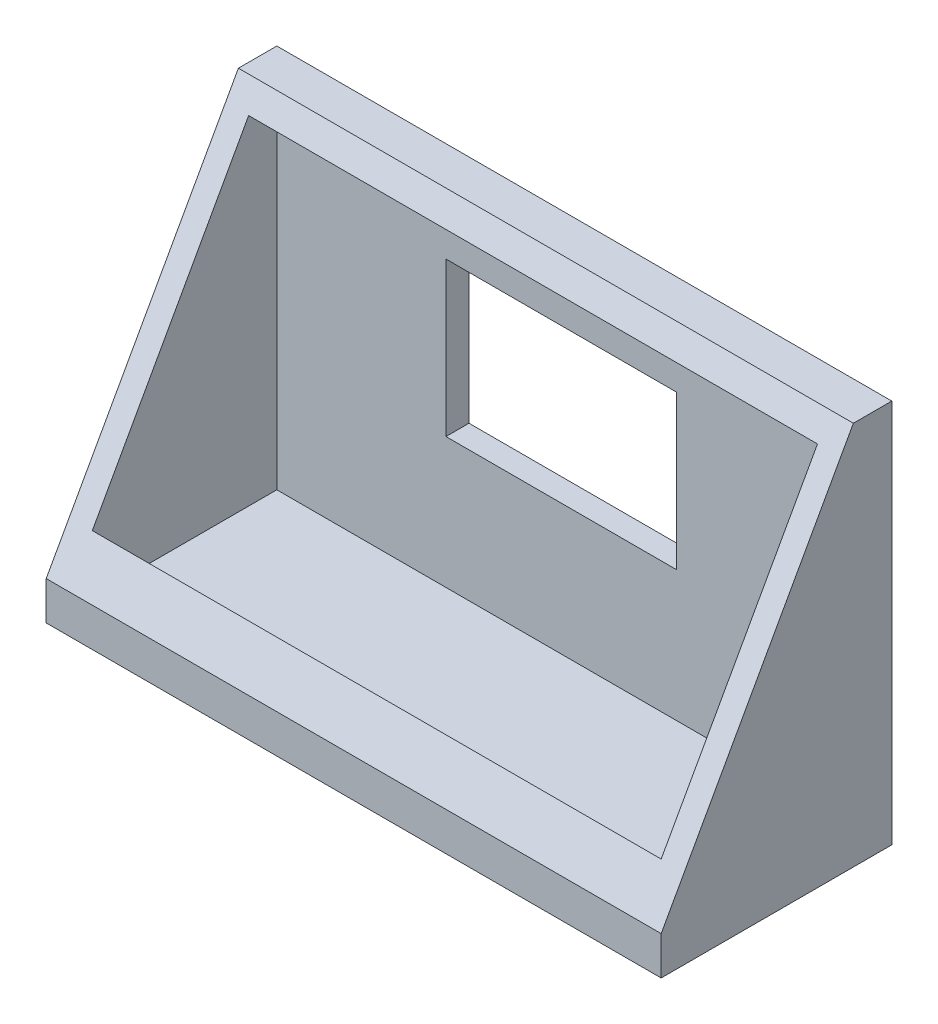
ISO-10303-21;
HEADER;
FILE_DESCRIPTION(('STEP AP214'),'2;1');
FILE_NAME('part.step','',(''),(''),'','','');
FILE_SCHEMA(('AUTOMOTIVE_DESIGN { 1 0 10303 214 1 1 1 1 }'));
ENDSEC;
DATA;
#1=APPLICATION_CONTEXT('core data for automotive mechanical design processes');
#2=APPLICATION_PROTOCOL_DEFINITION('international standard','automotive_design',2000,#1);
#3=PRODUCT_CONTEXT('',#1,'mechanical');
#4=PRODUCT('Part','Part','',(#3));
#5=PRODUCT_RELATED_PRODUCT_CATEGORY('part','',(#4));
#6=PRODUCT_DEFINITION_FORMATION('','',#4);
#7=PRODUCT_DEFINITION_CONTEXT('part definition',#1,'design');
#8=PRODUCT_DEFINITION('design','',#6,#7);
#9=PRODUCT_DEFINITION_SHAPE('','',#8);
#10=(LENGTH_UNIT() NAMED_UNIT(*) SI_UNIT(.MILLI.,.METRE.));
#11=(NAMED_UNIT(*) PLANE_ANGLE_UNIT() SI_UNIT($,.RADIAN.));
#12=(NAMED_UNIT(*) SI_UNIT($,.STERADIAN.) SOLID_ANGLE_UNIT());
#13=UNCERTAINTY_MEASURE_WITH_UNIT(LENGTH_MEASURE(1.E-05),#10,'distance_accuracy_value','');
#14=(GEOMETRIC_REPRESENTATION_CONTEXT(3) GLOBAL_UNCERTAINTY_ASSIGNED_CONTEXT((#13)) GLOBAL_UNIT_ASSIGNED_CONTEXT((#10,
#11,#12)) REPRESENTATION_CONTEXT('',''));
#15=CARTESIAN_POINT('',(0.,0.,0.));
#16=DIRECTION('',(0.,0.,1.));
#17=DIRECTION('',(1.,0.,0.));
#18=AXIS2_PLACEMENT_3D('',#15,#16,#17);
#19=CARTESIAN_POINT('',(40.,50.,5.));
#20=DIRECTION('',(0.,-0.485642931178632,-0.874157276121538));
#21=DIRECTION('',(0.,0.874157276121538,-0.485642931178632));
#22=AXIS2_PLACEMENT_3D('',#19,#20,#21);
#23=PLANE('',#22);
#24=DIRECTION('',(0.,-0.874157276121538,0.485642931178632));
#25=VECTOR('',#24,1.);
#26=CARTESIAN_POINT('',(-40.,50.,5.));
#27=LINE('',#26,#25);
#28=CARTESIAN_POINT('',(-40.,50.,5.));
#29=VERTEX_POINT('',#28);
#30=CARTESIAN_POINT('',(-40.,5.,30.));
#31=VERTEX_POINT('',#30);
#32=EDGE_CURVE('E220',#29,#31,#27,.T.);
#33=ORIENTED_EDGE('',*,*,#32,.T.);
#34=DIRECTION('',(-1.,0.,0.));
#35=VECTOR('',#34,1.);
#36=CARTESIAN_POINT('',(40.,5.,30.));
#37=LINE('',#36,#35);
#38=CARTESIAN_POINT('',(40.,5.,30.));
#39=VERTEX_POINT('',#38);
#40=EDGE_CURVE('E228',#39,#31,#37,.T.);
#41=ORIENTED_EDGE('',*,*,#40,.F.);
#42=DIRECTION('',(0.,-0.874157276121538,0.485642931178632));
#43=VECTOR('',#42,1.);
#44=CARTESIAN_POINT('',(40.,50.,5.));
#45=LINE('',#44,#43);
#46=CARTESIAN_POINT('',(40.,50.,5.));
#47=VERTEX_POINT('',#46);
#48=EDGE_CURVE('E226',#47,#39,#45,.T.);
#49=ORIENTED_EDGE('',*,*,#48,.F.);
#50=DIRECTION('',(-1.,0.,0.));
#51=VECTOR('',#50,1.);
#52=CARTESIAN_POINT('',(40.,50.,5.));
#53=LINE('',#52,#51);
#54=EDGE_CURVE('E240',#47,#29,#53,.T.);
#55=ORIENTED_EDGE('',*,*,#54,.T.);
#56=EDGE_LOOP('',(#33,#41,#49,#55));
#57=FACE_BOUND('',#56,.T.);
#58=DIRECTION('',(0.,-0.874157276121538,0.485642931178632));
#59=VECTOR('',#58,1.);
#60=CARTESIAN_POINT('',(-37.,50.,5.));
#61=LINE('',#60,#59);
#62=CARTESIAN_POINT('',(-37.,47.,6.66666666666667));
#63=VERTEX_POINT('',#62);
#64=CARTESIAN_POINT('',(-37.,10.4,27.));
#65=VERTEX_POINT('',#64);
#66=EDGE_CURVE('E189',#63,#65,#61,.T.);
#67=ORIENTED_EDGE('',*,*,#66,.F.);
#68=DIRECTION('',(-1.,0.,0.));
#69=VECTOR('',#68,1.);
#70=CARTESIAN_POINT('',(40.,47.,6.66666666666667));
#71=LINE('',#70,#69);
#72=CARTESIAN_POINT('',(37.,47.,6.66666666666667));
#73=VERTEX_POINT('',#72);
#74=EDGE_CURVE('E201',#73,#63,#71,.T.);
#75=ORIENTED_EDGE('',*,*,#74,.F.);
#76=DIRECTION('',(0.,-0.874157276121538,0.485642931178632));
#77=VECTOR('',#76,1.);
#78=CARTESIAN_POINT('',(37.,50.,5.));
#79=LINE('',#78,#77);
#80=CARTESIAN_POINT('',(37.,10.4,27.));
#81=VERTEX_POINT('',#80);
#82=EDGE_CURVE('E207',#73,#81,#79,.T.);
#83=ORIENTED_EDGE('',*,*,#82,.T.);
#84=DIRECTION('',(-1.,0.,0.));
#85=VECTOR('',#84,1.);
#86=CARTESIAN_POINT('',(40.,10.4,27.));
#87=LINE('',#86,#85);
#88=EDGE_CURVE('E208',#81,#65,#87,.T.);
#89=ORIENTED_EDGE('',*,*,#88,.T.);
#90=EDGE_LOOP('',(#67,#75,#83,#89));
#91=FACE_BOUND('',#90,.T.);
#92=ADVANCED_FACE('F47',(#57,#91),#23,.F.);
#93=CARTESIAN_POINT('',(40.,5.,30.));
#94=DIRECTION('',(0.,0.,-1.));
#95=DIRECTION('',(-1.,0.,0.));
#96=AXIS2_PLACEMENT_3D('',#93,#94,#95);
#97=PLANE('',#96);
#98=DIRECTION('',(0.,-1.,0.));
#99=VECTOR('',#98,1.);
#100=CARTESIAN_POINT('',(-40.,5.,30.));
#101=LINE('',#100,#99);
#102=CARTESIAN_POINT('',(-40.,0.,30.));
#103=VERTEX_POINT('',#102);
#104=EDGE_CURVE('E183',#31,#103,#101,.T.);
#105=ORIENTED_EDGE('',*,*,#104,.T.);
#106=DIRECTION('',(-1.,0.,0.));
#107=VECTOR('',#106,1.);
#108=CARTESIAN_POINT('',(40.,0.,30.));
#109=LINE('',#108,#107);
#110=CARTESIAN_POINT('',(40.,0.,30.));
#111=VERTEX_POINT('',#110);
#112=EDGE_CURVE('E249',#111,#103,#109,.T.);
#113=ORIENTED_EDGE('',*,*,#112,.F.);
#114=DIRECTION('',(0.,-1.,0.));
#115=VECTOR('',#114,1.);
#116=CARTESIAN_POINT('',(40.,5.,30.));
#117=LINE('',#116,#115);
#118=EDGE_CURVE('E216',#39,#111,#117,.T.);
#119=ORIENTED_EDGE('',*,*,#118,.F.);
#120=ORIENTED_EDGE('',*,*,#40,.T.);
#121=EDGE_LOOP('',(#105,#113,#119,#120));
#122=FACE_BOUND('',#121,.T.);
#123=ADVANCED_FACE('F49',(#122),#97,.F.);
#124=CARTESIAN_POINT('',(40.,0.,30.));
#125=DIRECTION('',(0.,1.,0.));
#126=DIRECTION('',(0.,0.,1.));
#127=AXIS2_PLACEMENT_3D('',#124,#125,#126);
#128=PLANE('',#127);
#129=DIRECTION('',(0.,0.,-1.));
#130=VECTOR('',#129,1.);
#131=CARTESIAN_POINT('',(-40.,0.,30.));
#132=LINE('',#131,#130);
#133=CARTESIAN_POINT('',(-40.,0.,0.));
#134=VERTEX_POINT('',#133);
#135=EDGE_CURVE('E231',#103,#134,#132,.T.);
#136=ORIENTED_EDGE('',*,*,#135,.T.);
#137=DIRECTION('',(-1.,0.,0.));
#138=VECTOR('',#137,1.);
#139=CARTESIAN_POINT('',(40.,0.,0.));
#140=LINE('',#139,#138);
#141=CARTESIAN_POINT('',(40.,0.,0.));
#142=VERTEX_POINT('',#141);
#143=EDGE_CURVE('E246',#142,#134,#140,.T.);
#144=ORIENTED_EDGE('',*,*,#143,.F.);
#145=DIRECTION('',(0.,0.,-1.));
#146=VECTOR('',#145,1.);
#147=CARTESIAN_POINT('',(40.,0.,30.));
#148=LINE('',#147,#146);
#149=EDGE_CURVE('E219',#111,#142,#148,.T.);
#150=ORIENTED_EDGE('',*,*,#149,.F.);
#151=ORIENTED_EDGE('',*,*,#112,.T.);
#152=EDGE_LOOP('',(#136,#144,#150,#151));
#153=FACE_BOUND('',#152,.T.);
#154=ADVANCED_FACE('F265',(#153),#128,.F.);
#155=CARTESIAN_POINT('',(40.,0.,0.));
#156=DIRECTION('',(0.,0.,1.));
#157=DIRECTION('',(1.,0.,0.));
#158=AXIS2_PLACEMENT_3D('',#155,#156,#157);
#159=PLANE('',#158);
#160=CARTESIAN_POINT('',(-30.,30.,0.));
#161=DIRECTION('',(0.,0.,1.));
#162=DIRECTION('',(1.,0.,0.));
#163=AXIS2_PLACEMENT_3D('',#160,#161,#162);
#164=CIRCLE('',#163,5.);
#165=CARTESIAN_POINT('',(-25.,30.,0.));
#166=VERTEX_POINT('',#165);
#167=EDGE_CURVE('E363',#166,#166,#164,.T.);
#168=ORIENTED_EDGE('',*,*,#167,.T.);
#169=EDGE_LOOP('',(#168));
#170=FACE_BOUND('',#169,.T.);
#171=CARTESIAN_POINT('',(30.,30.,0.));
#172=DIRECTION('',(0.,0.,1.));
#173=DIRECTION('',(1.,0.,0.));
#174=AXIS2_PLACEMENT_3D('',#171,#172,#173);
#175=CIRCLE('',#174,5.);
#176=CARTESIAN_POINT('',(35.,30.,0.));
#177=VERTEX_POINT('',#176);
#178=EDGE_CURVE('E55',#177,#177,#175,.F.);
#179=ORIENTED_EDGE('',*,*,#178,.F.);
#180=EDGE_LOOP('',(#179));
#181=FACE_BOUND('',#180,.T.);
#182=DIRECTION('',(0.,1.,0.));
#183=VECTOR('',#182,1.);
#184=CARTESIAN_POINT('',(15.,20.,0.));
#185=LINE('',#184,#183);
#186=CARTESIAN_POINT('',(15.,20.,0.));
#187=VERTEX_POINT('',#186);
#188=CARTESIAN_POINT('',(15.,40.,0.));
#189=VERTEX_POINT('',#188);
#190=EDGE_CURVE('E160',#187,#189,#185,.T.);
#191=ORIENTED_EDGE('',*,*,#190,.T.);
#192=DIRECTION('',(1.,0.,0.));
#193=VECTOR('',#192,1.);
#194=CARTESIAN_POINT('',(-15.,40.,0.));
#195=LINE('',#194,#193);
#196=CARTESIAN_POINT('',(-15.,40.,0.));
#197=VERTEX_POINT('',#196);
#198=EDGE_CURVE('E62',#197,#189,#195,.T.);
#199=ORIENTED_EDGE('',*,*,#198,.F.);
#200=DIRECTION('',(0.,1.,0.));
#201=VECTOR('',#200,1.);
#202=CARTESIAN_POINT('',(-15.,20.,0.));
#203=LINE('',#202,#201);
#204=CARTESIAN_POINT('',(-15.,20.,0.));
#205=VERTEX_POINT('',#204);
#206=EDGE_CURVE('E167',#205,#197,#203,.T.);
#207=ORIENTED_EDGE('',*,*,#206,.F.);
#208=DIRECTION('',(1.,0.,0.));
#209=VECTOR('',#208,1.);
#210=CARTESIAN_POINT('',(-15.,20.,0.));
#211=LINE('',#210,#209);
#212=EDGE_CURVE('E151',#205,#187,#211,.T.);
#213=ORIENTED_EDGE('',*,*,#212,.T.);
#214=EDGE_LOOP('',(#191,#199,#207,#213));
#215=FACE_BOUND('',#214,.T.);
#216=DIRECTION('',(0.,1.,0.));
#217=VECTOR('',#216,1.);
#218=CARTESIAN_POINT('',(-40.,0.,0.));
#219=LINE('',#218,#217);
#220=CARTESIAN_POINT('',(-40.,50.,0.));
#221=VERTEX_POINT('',#220);
#222=EDGE_CURVE('E233',#134,#221,#219,.T.);
#223=ORIENTED_EDGE('',*,*,#222,.T.);
#224=DIRECTION('',(-1.,0.,0.));
#225=VECTOR('',#224,1.);
#226=CARTESIAN_POINT('',(40.,50.,0.));
#227=LINE('',#226,#225);
#228=CARTESIAN_POINT('',(40.,50.,0.));
#229=VERTEX_POINT('',#228);
#230=EDGE_CURVE('E243',#229,#221,#227,.T.);
#231=ORIENTED_EDGE('',*,*,#230,.F.);
#232=DIRECTION('',(0.,1.,0.));
#233=VECTOR('',#232,1.);
#234=CARTESIAN_POINT('',(40.,0.,0.));
#235=LINE('',#234,#233);
#236=EDGE_CURVE('E222',#142,#229,#235,.T.);
#237=ORIENTED_EDGE('',*,*,#236,.F.);
#238=ORIENTED_EDGE('',*,*,#143,.T.);
#239=EDGE_LOOP('',(#223,#231,#237,#238));
#240=FACE_BOUND('',#239,.T.);
#241=ADVANCED_FACE('F164',(#170,#181,#215,#240),#159,.F.);
#242=CARTESIAN_POINT('',(40.,50.,0.));
#243=DIRECTION('',(0.,-1.,0.));
#244=DIRECTION('',(0.,0.,-1.));
#245=AXIS2_PLACEMENT_3D('',#242,#243,#244);
#246=PLANE('',#245);
#247=DIRECTION('',(0.,0.,1.));
#248=VECTOR('',#247,1.);
#249=CARTESIAN_POINT('',(-40.,50.,0.));
#250=LINE('',#249,#248);
#251=EDGE_CURVE('E235',#221,#29,#250,.T.);
#252=ORIENTED_EDGE('',*,*,#251,.T.);
#253=ORIENTED_EDGE('',*,*,#54,.F.);
#254=DIRECTION('',(0.,0.,1.));
#255=VECTOR('',#254,1.);
#256=CARTESIAN_POINT('',(40.,50.,0.));
#257=LINE('',#256,#255);
#258=EDGE_CURVE('E224',#229,#47,#257,.T.);
#259=ORIENTED_EDGE('',*,*,#258,.F.);
#260=ORIENTED_EDGE('',*,*,#230,.T.);
#261=EDGE_LOOP('',(#252,#253,#259,#260));
#262=FACE_BOUND('',#261,.T.);
#263=ADVANCED_FACE('F264',(#262),#246,.F.);
#264=CARTESIAN_POINT('',(40.,0.,0.));
#265=DIRECTION('',(1.,0.,0.));
#266=DIRECTION('',(0.,0.,-1.));
#267=AXIS2_PLACEMENT_3D('',#264,#265,#266);
#268=PLANE('',#267);
#269=ORIENTED_EDGE('',*,*,#118,.T.);
#270=ORIENTED_EDGE('',*,*,#149,.T.);
#271=ORIENTED_EDGE('',*,*,#236,.T.);
#272=ORIENTED_EDGE('',*,*,#258,.T.);
#273=ORIENTED_EDGE('',*,*,#48,.T.);
#274=EDGE_LOOP('',(#269,#270,#271,#272,#273));
#275=FACE_BOUND('',#274,.T.);
#276=ADVANCED_FACE('F274',(#275),#268,.T.);
#277=CARTESIAN_POINT('',(-40.,0.,0.));
#278=DIRECTION('',(1.,0.,0.));
#279=DIRECTION('',(0.,0.,-1.));
#280=AXIS2_PLACEMENT_3D('',#277,#278,#279);
#281=PLANE('',#280);
#282=ORIENTED_EDGE('',*,*,#104,.F.);
#283=ORIENTED_EDGE('',*,*,#32,.F.);
#284=ORIENTED_EDGE('',*,*,#251,.F.);
#285=ORIENTED_EDGE('',*,*,#222,.F.);
#286=ORIENTED_EDGE('',*,*,#135,.F.);
#287=EDGE_LOOP('',(#282,#283,#284,#285,#286));
#288=FACE_BOUND('',#287,.T.);
#289=ADVANCED_FACE('F295',(#288),#281,.F.);
#290=CARTESIAN_POINT('',(40.,5.,27.));
#291=DIRECTION('',(0.,0.,-1.));
#292=DIRECTION('',(-1.,0.,0.));
#293=AXIS2_PLACEMENT_3D('',#290,#291,#292);
#294=PLANE('',#293);
#295=DIRECTION('',(0.,-1.,0.));
#296=VECTOR('',#295,1.);
#297=CARTESIAN_POINT('',(-37.,5.,27.));
#298=LINE('',#297,#296);
#299=CARTESIAN_POINT('',(-37.,3.,27.));
#300=VERTEX_POINT('',#299);
#301=EDGE_CURVE('E174',#65,#300,#298,.T.);
#302=ORIENTED_EDGE('',*,*,#301,.F.);
#303=ORIENTED_EDGE('',*,*,#88,.F.);
#304=DIRECTION('',(0.,-1.,0.));
#305=VECTOR('',#304,1.);
#306=CARTESIAN_POINT('',(37.,5.,27.));
#307=LINE('',#306,#305);
#308=CARTESIAN_POINT('',(37.,3.,27.));
#309=VERTEX_POINT('',#308);
#310=EDGE_CURVE('E185',#81,#309,#307,.T.);
#311=ORIENTED_EDGE('',*,*,#310,.T.);
#312=DIRECTION('',(-1.,0.,0.));
#313=VECTOR('',#312,1.);
#314=CARTESIAN_POINT('',(40.,3.,27.));
#315=LINE('',#314,#313);
#316=EDGE_CURVE('E180',#309,#300,#315,.T.);
#317=ORIENTED_EDGE('',*,*,#316,.T.);
#318=EDGE_LOOP('',(#302,#303,#311,#317));
#319=FACE_BOUND('',#318,.T.);
#320=ADVANCED_FACE('F298',(#319),#294,.T.);
#321=CARTESIAN_POINT('',(40.,3.,30.));
#322=DIRECTION('',(0.,1.,0.));
#323=DIRECTION('',(0.,0.,1.));
#324=AXIS2_PLACEMENT_3D('',#321,#322,#323);
#325=PLANE('',#324);
#326=DIRECTION('',(0.,0.,-1.));
#327=VECTOR('',#326,1.);
#328=CARTESIAN_POINT('',(-37.,3.,30.));
#329=LINE('',#328,#327);
#330=CARTESIAN_POINT('',(-37.,3.,3.));
#331=VERTEX_POINT('',#330);
#332=EDGE_CURVE('E179',#300,#331,#329,.T.);
#333=ORIENTED_EDGE('',*,*,#332,.F.);
#334=ORIENTED_EDGE('',*,*,#316,.F.);
#335=DIRECTION('',(0.,0.,-1.));
#336=VECTOR('',#335,1.);
#337=CARTESIAN_POINT('',(37.,3.,30.));
#338=LINE('',#337,#336);
#339=CARTESIAN_POINT('',(37.,3.,3.));
#340=VERTEX_POINT('',#339);
#341=EDGE_CURVE('E188',#309,#340,#338,.T.);
#342=ORIENTED_EDGE('',*,*,#341,.T.);
#343=DIRECTION('',(-1.,0.,0.));
#344=VECTOR('',#343,1.);
#345=CARTESIAN_POINT('',(40.,3.,3.));
#346=LINE('',#345,#344);
#347=EDGE_CURVE('E184',#340,#331,#346,.T.);
#348=ORIENTED_EDGE('',*,*,#347,.T.);
#349=EDGE_LOOP('',(#333,#334,#342,#348));
#350=FACE_BOUND('',#349,.T.);
#351=ADVANCED_FACE('F319',(#350),#325,.T.);
#352=CARTESIAN_POINT('',(40.,0.,3.));
#353=DIRECTION('',(0.,0.,1.));
#354=DIRECTION('',(1.,0.,0.));
#355=AXIS2_PLACEMENT_3D('',#352,#353,#354);
#356=PLANE('',#355);
#357=DIRECTION('',(-1.,0.,0.));
#358=VECTOR('',#357,1.);
#359=CARTESIAN_POINT('',(40.,40.,3.));
#360=LINE('',#359,#358);
#361=CARTESIAN_POINT('',(15.,40.,3.));
#362=VERTEX_POINT('',#361);
#363=CARTESIAN_POINT('',(-15.,40.,3.));
#364=VERTEX_POINT('',#363);
#365=EDGE_CURVE('E257',#362,#364,#360,.T.);
#366=ORIENTED_EDGE('',*,*,#365,.F.);
#367=DIRECTION('',(0.,-1.,0.));
#368=VECTOR('',#367,1.);
#369=CARTESIAN_POINT('',(15.,0.,3.));
#370=LINE('',#369,#368);
#371=CARTESIAN_POINT('',(15.,20.,3.));
#372=VERTEX_POINT('',#371);
#373=EDGE_CURVE('E252',#362,#372,#370,.T.);
#374=ORIENTED_EDGE('',*,*,#373,.T.);
#375=DIRECTION('',(-1.,0.,0.));
#376=VECTOR('',#375,1.);
#377=CARTESIAN_POINT('',(40.,20.,3.));
#378=LINE('',#377,#376);
#379=CARTESIAN_POINT('',(-15.,20.,3.));
#380=VERTEX_POINT('',#379);
#381=EDGE_CURVE('E154',#372,#380,#378,.T.);
#382=ORIENTED_EDGE('',*,*,#381,.T.);
#383=DIRECTION('',(0.,-1.,0.));
#384=VECTOR('',#383,1.);
#385=CARTESIAN_POINT('',(-15.,0.,3.));
#386=LINE('',#385,#384);
#387=EDGE_CURVE('E255',#364,#380,#386,.T.);
#388=ORIENTED_EDGE('',*,*,#387,.F.);
#389=EDGE_LOOP('',(#366,#374,#382,#388));
#390=FACE_BOUND('',#389,.T.);
#391=DIRECTION('',(0.,1.,0.));
#392=VECTOR('',#391,1.);
#393=CARTESIAN_POINT('',(-37.,0.,3.));
#394=LINE('',#393,#392);
#395=CARTESIAN_POINT('',(-37.,47.,3.));
#396=VERTEX_POINT('',#395);
#397=EDGE_CURVE('E191',#331,#396,#394,.T.);
#398=ORIENTED_EDGE('',*,*,#397,.F.);
#399=ORIENTED_EDGE('',*,*,#347,.F.);
#400=DIRECTION('',(0.,1.,0.));
#401=VECTOR('',#400,1.);
#402=CARTESIAN_POINT('',(37.,0.,3.));
#403=LINE('',#402,#401);
#404=CARTESIAN_POINT('',(37.,47.,3.));
#405=VERTEX_POINT('',#404);
#406=EDGE_CURVE('E196',#340,#405,#403,.T.);
#407=ORIENTED_EDGE('',*,*,#406,.T.);
#408=DIRECTION('',(-1.,0.,0.));
#409=VECTOR('',#408,1.);
#410=CARTESIAN_POINT('',(40.,47.,3.));
#411=LINE('',#410,#409);
#412=EDGE_CURVE('E194',#405,#396,#411,.T.);
#413=ORIENTED_EDGE('',*,*,#412,.T.);
#414=EDGE_LOOP('',(#398,#399,#407,#413));
#415=FACE_BOUND('',#414,.T.);
#416=ADVANCED_FACE('F315',(#390,#415),#356,.T.);
#417=CARTESIAN_POINT('',(40.,47.,0.));
#418=DIRECTION('',(0.,-1.,0.));
#419=DIRECTION('',(0.,0.,-1.));
#420=AXIS2_PLACEMENT_3D('',#417,#418,#419);
#421=PLANE('',#420);
#422=DIRECTION('',(0.,0.,1.));
#423=VECTOR('',#422,1.);
#424=CARTESIAN_POINT('',(-37.,47.,0.));
#425=LINE('',#424,#423);
#426=EDGE_CURVE('E198',#396,#63,#425,.T.);
#427=ORIENTED_EDGE('',*,*,#426,.F.);
#428=ORIENTED_EDGE('',*,*,#412,.F.);
#429=DIRECTION('',(0.,0.,1.));
#430=VECTOR('',#429,1.);
#431=CARTESIAN_POINT('',(37.,47.,0.));
#432=LINE('',#431,#430);
#433=EDGE_CURVE('E203',#405,#73,#432,.T.);
#434=ORIENTED_EDGE('',*,*,#433,.T.);
#435=ORIENTED_EDGE('',*,*,#74,.T.);
#436=EDGE_LOOP('',(#427,#428,#434,#435));
#437=FACE_BOUND('',#436,.T.);
#438=ADVANCED_FACE('F311',(#437),#421,.T.);
#439=CARTESIAN_POINT('',(37.,0.,0.));
#440=DIRECTION('',(1.,0.,0.));
#441=DIRECTION('',(0.,0.,-1.));
#442=AXIS2_PLACEMENT_3D('',#439,#440,#441);
#443=PLANE('',#442);
#444=ORIENTED_EDGE('',*,*,#310,.F.);
#445=ORIENTED_EDGE('',*,*,#82,.F.);
#446=ORIENTED_EDGE('',*,*,#433,.F.);
#447=ORIENTED_EDGE('',*,*,#406,.F.);
#448=ORIENTED_EDGE('',*,*,#341,.F.);
#449=EDGE_LOOP('',(#444,#445,#446,#447,#448));
#450=FACE_BOUND('',#449,.T.);
#451=ADVANCED_FACE('F307',(#450),#443,.F.);
#452=CARTESIAN_POINT('',(-37.,0.,0.));
#453=DIRECTION('',(1.,0.,0.));
#454=DIRECTION('',(0.,0.,-1.));
#455=AXIS2_PLACEMENT_3D('',#452,#453,#454);
#456=PLANE('',#455);
#457=ORIENTED_EDGE('',*,*,#301,.T.);
#458=ORIENTED_EDGE('',*,*,#332,.T.);
#459=ORIENTED_EDGE('',*,*,#397,.T.);
#460=ORIENTED_EDGE('',*,*,#426,.T.);
#461=ORIENTED_EDGE('',*,*,#66,.T.);
#462=EDGE_LOOP('',(#457,#458,#459,#460,#461));
#463=FACE_BOUND('',#462,.T.);
#464=ADVANCED_FACE('F303',(#463),#456,.T.);
#465=CARTESIAN_POINT('',(-15.,40.,80.));
#466=DIRECTION('',(0.,1.,0.));
#467=DIRECTION('',(-1.,0.,0.));
#468=AXIS2_PLACEMENT_3D('',#465,#466,#467);
#469=PLANE('',#468);
#470=ORIENTED_EDGE('',*,*,#365,.T.);
#471=DIRECTION('',(0.,0.,-1.));
#472=VECTOR('',#471,1.);
#473=CARTESIAN_POINT('',(-15.,40.,80.));
#474=LINE('',#473,#472);
#475=EDGE_CURVE('E172',#364,#197,#474,.T.);
#476=ORIENTED_EDGE('',*,*,#475,.T.);
#477=ORIENTED_EDGE('',*,*,#198,.T.);
#478=DIRECTION('',(0.,0.,-1.));
#479=VECTOR('',#478,1.);
#480=CARTESIAN_POINT('',(15.,40.,80.));
#481=LINE('',#480,#479);
#482=EDGE_CURVE('E157',#362,#189,#481,.T.);
#483=ORIENTED_EDGE('',*,*,#482,.F.);
#484=EDGE_LOOP('',(#470,#476,#477,#483));
#485=FACE_BOUND('',#484,.T.);
#486=ADVANCED_FACE('F306',(#485),#469,.F.);
#487=CARTESIAN_POINT('',(-15.,20.,80.));
#488=DIRECTION('',(-1.,0.,0.));
#489=DIRECTION('',(0.,-1.,0.));
#490=AXIS2_PLACEMENT_3D('',#487,#488,#489);
#491=PLANE('',#490);
#492=ORIENTED_EDGE('',*,*,#387,.T.);
#493=DIRECTION('',(0.,0.,-1.));
#494=VECTOR('',#493,1.);
#495=CARTESIAN_POINT('',(-15.,20.,80.));
#496=LINE('',#495,#494);
#497=EDGE_CURVE('E156',#380,#205,#496,.T.);
#498=ORIENTED_EDGE('',*,*,#497,.T.);
#499=ORIENTED_EDGE('',*,*,#206,.T.);
#500=ORIENTED_EDGE('',*,*,#475,.F.);
#501=EDGE_LOOP('',(#492,#498,#499,#500));
#502=FACE_BOUND('',#501,.T.);
#503=ADVANCED_FACE('F329',(#502),#491,.F.);
#504=CARTESIAN_POINT('',(-15.,20.,80.));
#505=DIRECTION('',(0.,1.,0.));
#506=DIRECTION('',(-1.,0.,0.));
#507=AXIS2_PLACEMENT_3D('',#504,#505,#506);
#508=PLANE('',#507);
#509=DIRECTION('',(0.,0.,-1.));
#510=VECTOR('',#509,1.);
#511=CARTESIAN_POINT('',(15.,20.,80.));
#512=LINE('',#511,#510);
#513=EDGE_CURVE('E70',#372,#187,#512,.T.);
#514=ORIENTED_EDGE('',*,*,#513,.T.);
#515=ORIENTED_EDGE('',*,*,#212,.F.);
#516=ORIENTED_EDGE('',*,*,#497,.F.);
#517=ORIENTED_EDGE('',*,*,#381,.F.);
#518=EDGE_LOOP('',(#514,#515,#516,#517));
#519=FACE_BOUND('',#518,.T.);
#520=ADVANCED_FACE('F148',(#519),#508,.T.);
#521=CARTESIAN_POINT('',(15.,20.,80.));
#522=DIRECTION('',(-1.,0.,0.));
#523=DIRECTION('',(0.,-1.,0.));
#524=AXIS2_PLACEMENT_3D('',#521,#522,#523);
#525=PLANE('',#524);
#526=ORIENTED_EDGE('',*,*,#482,.T.);
#527=ORIENTED_EDGE('',*,*,#190,.F.);
#528=ORIENTED_EDGE('',*,*,#513,.F.);
#529=ORIENTED_EDGE('',*,*,#373,.F.);
#530=EDGE_LOOP('',(#526,#527,#528,#529));
#531=FACE_BOUND('',#530,.T.);
#532=ADVANCED_FACE('F161',(#531),#525,.T.);
#533=CARTESIAN_POINT('',(30.,30.,-5.));
#534=DIRECTION('',(0.,0.,-1.));
#535=DIRECTION('',(-1.,0.,0.));
#536=AXIS2_PLACEMENT_3D('',#533,#534,#535);
#537=PLANE('',#536);
#538=CARTESIAN_POINT('',(30.,30.,-5.));
#539=DIRECTION('',(0.,0.,-1.));
#540=DIRECTION('',(-1.,0.,0.));
#541=AXIS2_PLACEMENT_3D('',#538,#539,#540);
#542=CIRCLE('',#541,5.);
#543=CARTESIAN_POINT('',(25.,30.,-5.));
#544=VERTEX_POINT('',#543);
#545=EDGE_CURVE('E374',#544,#544,#542,.T.);
#546=ORIENTED_EDGE('',*,*,#545,.T.);
#547=EDGE_LOOP('',(#546));
#548=FACE_BOUND('',#547,.T.);
#549=CARTESIAN_POINT('',(30.,30.,-5.));
#550=DIRECTION('',(0.,0.,-1.));
#551=DIRECTION('',(-1.,0.,0.));
#552=AXIS2_PLACEMENT_3D('',#549,#550,#551);
#553=CIRCLE('',#552,4.);
#554=CARTESIAN_POINT('',(26.,30.,-5.));
#555=VERTEX_POINT('',#554);
#556=EDGE_CURVE('E371',#555,#555,#553,.T.);
#557=ORIENTED_EDGE('',*,*,#556,.F.);
#558=EDGE_LOOP('',(#557));
#559=FACE_BOUND('',#558,.T.);
#560=ADVANCED_FACE('F332',(#548,#559),#537,.T.);
#561=CARTESIAN_POINT('',(30.,30.,-5.));
#562=DIRECTION('',(0.,0.,1.));
#563=DIRECTION('',(1.,0.,0.));
#564=AXIS2_PLACEMENT_3D('',#561,#562,#563);
#565=CYLINDRICAL_SURFACE('',#564,5.);
#566=ORIENTED_EDGE('',*,*,#545,.F.);
#567=EDGE_LOOP('',(#566));
#568=FACE_BOUND('',#567,.T.);
#569=ORIENTED_EDGE('',*,*,#178,.T.);
#570=EDGE_LOOP('',(#569));
#571=FACE_BOUND('',#570,.T.);
#572=ADVANCED_FACE('F261',(#568,#571),#565,.T.);
#573=CARTESIAN_POINT('',(30.,30.,-5.));
#574=DIRECTION('',(0.,0.,1.));
#575=DIRECTION('',(1.,0.,0.));
#576=AXIS2_PLACEMENT_3D('',#573,#574,#575);
#577=CYLINDRICAL_SURFACE('',#576,4.);
#578=ORIENTED_EDGE('',*,*,#556,.T.);
#579=EDGE_LOOP('',(#578));
#580=FACE_BOUND('',#579,.T.);
#581=CARTESIAN_POINT('',(30.,30.,0.));
#582=DIRECTION('',(0.,0.,-1.));
#583=DIRECTION('',(-1.,0.,0.));
#584=AXIS2_PLACEMENT_3D('',#581,#582,#583);
#585=CIRCLE('',#584,4.);
#586=CARTESIAN_POINT('',(26.,30.,0.));
#587=VERTEX_POINT('',#586);
#588=EDGE_CURVE('E369',#587,#587,#585,.T.);
#589=ORIENTED_EDGE('',*,*,#588,.F.);
#590=EDGE_LOOP('',(#589));
#591=FACE_BOUND('',#590,.T.);
#592=ADVANCED_FACE('F284',(#580,#591),#577,.F.);
#593=ORIENTED_EDGE('',*,*,#588,.T.);
#594=EDGE_LOOP('',(#593));
#595=FACE_BOUND('',#594,.T.);
#596=ADVANCED_FACE('F269',(#595),#159,.F.);
#597=CARTESIAN_POINT('',(-30.,30.,-5.));
#598=DIRECTION('',(0.,0.,1.));
#599=DIRECTION('',(1.,0.,0.));
#600=AXIS2_PLACEMENT_3D('',#597,#598,#599);
#601=CYLINDRICAL_SURFACE('',#600,5.);
#602=CARTESIAN_POINT('',(-30.,30.,-5.));
#603=DIRECTION('',(0.,0.,1.));
#604=DIRECTION('',(1.,0.,0.));
#605=AXIS2_PLACEMENT_3D('',#602,#603,#604);
#606=CIRCLE('',#605,5.);
#607=CARTESIAN_POINT('',(-25.,30.,-5.));
#608=VERTEX_POINT('',#607);
#609=EDGE_CURVE('E365',#608,#608,#606,.T.);
#610=ORIENTED_EDGE('',*,*,#609,.T.);
#611=EDGE_LOOP('',(#610));
#612=FACE_BOUND('',#611,.T.);
#613=ORIENTED_EDGE('',*,*,#167,.F.);
#614=EDGE_LOOP('',(#613));
#615=FACE_BOUND('',#614,.T.);
#616=ADVANCED_FACE('F283',(#612,#615),#601,.T.);
#617=CARTESIAN_POINT('',(-30.,30.,-5.));
#618=DIRECTION('',(0.,0.,-1.));
#619=DIRECTION('',(1.,0.,0.));
#620=AXIS2_PLACEMENT_3D('',#617,#618,#619);
#621=PLANE('',#620);
#622=CARTESIAN_POINT('',(-30.,30.,-5.));
#623=DIRECTION('',(0.,0.,1.));
#624=DIRECTION('',(1.,0.,0.));
#625=AXIS2_PLACEMENT_3D('',#622,#623,#624);
#626=CIRCLE('',#625,4.);
#627=CARTESIAN_POINT('',(-26.,30.,-5.));
#628=VERTEX_POINT('',#627);
#629=EDGE_CURVE('E361',#628,#628,#626,.T.);
#630=ORIENTED_EDGE('',*,*,#629,.T.);
#631=EDGE_LOOP('',(#630));
#632=FACE_BOUND('',#631,.T.);
#633=ORIENTED_EDGE('',*,*,#609,.F.);
#634=EDGE_LOOP('',(#633));
#635=FACE_BOUND('',#634,.T.);
#636=ADVANCED_FACE('F349',(#632,#635),#621,.T.);
#637=CARTESIAN_POINT('',(-30.,30.,-5.));
#638=DIRECTION('',(0.,0.,1.));
#639=DIRECTION('',(1.,0.,0.));
#640=AXIS2_PLACEMENT_3D('',#637,#638,#639);
#641=CYLINDRICAL_SURFACE('',#640,4.);
#642=ORIENTED_EDGE('',*,*,#629,.F.);
#643=EDGE_LOOP('',(#642));
#644=FACE_BOUND('',#643,.T.);
#645=CARTESIAN_POINT('',(-30.,30.,0.));
#646=DIRECTION('',(0.,0.,1.));
#647=DIRECTION('',(1.,0.,0.));
#648=AXIS2_PLACEMENT_3D('',#645,#646,#647);
#649=CIRCLE('',#648,4.);
#650=CARTESIAN_POINT('',(-26.,30.,0.));
#651=VERTEX_POINT('',#650);
#652=EDGE_CURVE('E12',#651,#651,#649,.T.);
#653=ORIENTED_EDGE('',*,*,#652,.T.);
#654=EDGE_LOOP('',(#653));
#655=FACE_BOUND('',#654,.T.);
#656=ADVANCED_FACE('F280',(#644,#655),#641,.F.);
#657=ORIENTED_EDGE('',*,*,#652,.F.);
#658=EDGE_LOOP('',(#657));
#659=FACE_BOUND('',#658,.T.);
#660=ADVANCED_FACE('F268',(#659),#159,.F.);
#661=CLOSED_SHELL('',(#92,#123,#154,#241,#263,#276,#289,#320,#351,#416,#438,#451,#464,#486,#503,
#520,#532,#560,#572,#592,#596,#616,#636,#656,#660));
#662=MANIFOLD_SOLID_BREP('B2',#661);
#663=ADVANCED_BREP_SHAPE_REPRESENTATION('',(#18,#662),#14);
#664=SHAPE_DEFINITION_REPRESENTATION(#9,#663);
ENDSEC;
END-ISO-10303-21;
